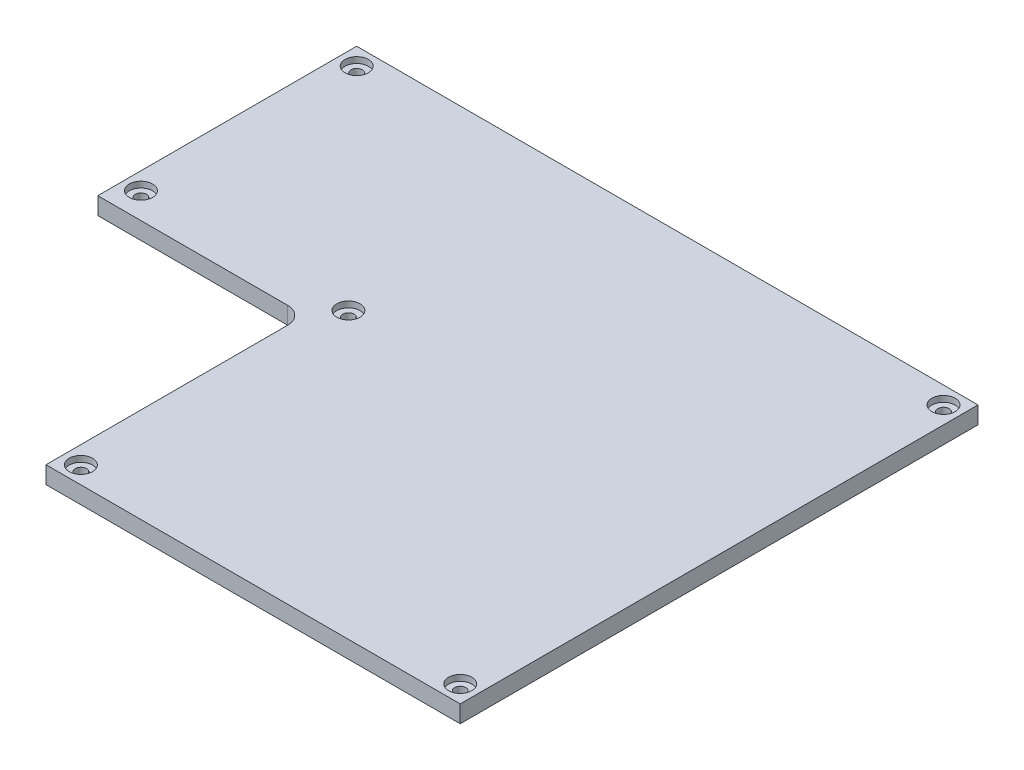
ISO-10303-21;
HEADER;
FILE_DESCRIPTION(('STEP AP214'),'2;1');
FILE_NAME('part.step','',(''),(''),'','','');
FILE_SCHEMA(('AUTOMOTIVE_DESIGN { 1 0 10303 214 1 1 1 1 }'));
ENDSEC;
DATA;
#1=APPLICATION_CONTEXT('core data for automotive mechanical design processes');
#2=APPLICATION_PROTOCOL_DEFINITION('international standard','automotive_design',2000,#1);
#3=PRODUCT_CONTEXT('',#1,'mechanical');
#4=PRODUCT('Part','Part','',(#3));
#5=PRODUCT_RELATED_PRODUCT_CATEGORY('part','',(#4));
#6=PRODUCT_DEFINITION_FORMATION('','',#4);
#7=PRODUCT_DEFINITION_CONTEXT('part definition',#1,'design');
#8=PRODUCT_DEFINITION('design','',#6,#7);
#9=PRODUCT_DEFINITION_SHAPE('','',#8);
#10=(LENGTH_UNIT() NAMED_UNIT(*) SI_UNIT(.MILLI.,.METRE.));
#11=(NAMED_UNIT(*) PLANE_ANGLE_UNIT() SI_UNIT($,.RADIAN.));
#12=(NAMED_UNIT(*) SI_UNIT($,.STERADIAN.) SOLID_ANGLE_UNIT());
#13=UNCERTAINTY_MEASURE_WITH_UNIT(LENGTH_MEASURE(1.E-05),#10,'distance_accuracy_value','');
#14=(GEOMETRIC_REPRESENTATION_CONTEXT(3) GLOBAL_UNCERTAINTY_ASSIGNED_CONTEXT((#13)) GLOBAL_UNIT_ASSIGNED_CONTEXT((#10,
#11,#12)) REPRESENTATION_CONTEXT('',''));
#15=CARTESIAN_POINT('',(0.,0.,0.));
#16=DIRECTION('',(0.,0.,1.));
#17=DIRECTION('',(1.,0.,0.));
#18=AXIS2_PLACEMENT_3D('',#15,#16,#17);
#19=CARTESIAN_POINT('',(-15.9558823529412,5.,23.9705882352941));
#20=DIRECTION('',(0.,-1.,0.));
#21=DIRECTION('',(0.,0.,-1.));
#22=AXIS2_PLACEMENT_3D('',#19,#20,#21);
#23=CYLINDRICAL_SURFACE('',#22,5.);
#24=CARTESIAN_POINT('',(-15.9558823529412,0.,23.9705882352941));
#25=DIRECTION('',(0.,1.,0.));
#26=DIRECTION('',(0.,0.,1.));
#27=AXIS2_PLACEMENT_3D('',#24,#25,#26);
#28=CIRCLE('',#27,5.);
#29=CARTESIAN_POINT('',(-10.9558823529412,0.,23.9705882352942));
#30=VERTEX_POINT('',#29);
#31=CARTESIAN_POINT('',(-15.9558823529412,0.,18.9705882352941));
#32=VERTEX_POINT('',#31);
#33=EDGE_CURVE('E127',#30,#32,#28,.T.);
#34=ORIENTED_EDGE('',*,*,#33,.F.);
#35=DIRECTION('',(0.,-1.,0.));
#36=VECTOR('',#35,1.);
#37=CARTESIAN_POINT('',(-10.9558823529412,5.,23.9705882352942));
#38=LINE('',#37,#36);
#39=CARTESIAN_POINT('',(-10.9558823529412,5.,23.9705882352942));
#40=VERTEX_POINT('',#39);
#41=EDGE_CURVE('E11',#40,#30,#38,.T.);
#42=ORIENTED_EDGE('',*,*,#41,.F.);
#43=CARTESIAN_POINT('',(-15.9558823529412,5.,23.9705882352941));
#44=DIRECTION('',(0.,1.,0.));
#45=DIRECTION('',(0.,0.,1.));
#46=AXIS2_PLACEMENT_3D('',#43,#44,#45);
#47=CIRCLE('',#46,5.);
#48=CARTESIAN_POINT('',(-15.9558823529412,5.,18.9705882352941));
#49=VERTEX_POINT('',#48);
#50=EDGE_CURVE('E144',#40,#49,#47,.T.);
#51=ORIENTED_EDGE('',*,*,#50,.T.);
#52=DIRECTION('',(0.,-1.,0.));
#53=VECTOR('',#52,1.);
#54=CARTESIAN_POINT('',(-15.9558823529412,5.,18.9705882352941));
#55=LINE('',#54,#53);
#56=EDGE_CURVE('E85',#49,#32,#55,.T.);
#57=ORIENTED_EDGE('',*,*,#56,.T.);
#58=EDGE_LOOP('',(#34,#42,#51,#57));
#59=FACE_BOUND('',#58,.T.);
#60=ADVANCED_FACE('F38',(#59),#23,.F.);
#61=CARTESIAN_POINT('',(-10.9558823529412,5.,0.));
#62=DIRECTION('',(1.,0.,0.));
#63=DIRECTION('',(0.,0.,-1.));
#64=AXIS2_PLACEMENT_3D('',#61,#62,#63);
#65=PLANE('',#64);
#66=DIRECTION('',(0.,0.,1.));
#67=VECTOR('',#66,1.);
#68=CARTESIAN_POINT('',(-10.9558823529412,0.,0.));
#69=LINE('',#68,#67);
#70=CARTESIAN_POINT('',(-10.9558823529411,0.,93.9705882352941));
#71=VERTEX_POINT('',#70);
#72=EDGE_CURVE('E130',#30,#71,#69,.T.);
#73=ORIENTED_EDGE('',*,*,#72,.T.);
#74=DIRECTION('',(0.,-1.,0.));
#75=VECTOR('',#74,1.);
#76=CARTESIAN_POINT('',(-10.9558823529411,5.,93.9705882352941));
#77=LINE('',#76,#75);
#78=CARTESIAN_POINT('',(-10.9558823529411,5.,93.9705882352941));
#79=VERTEX_POINT('',#78);
#80=EDGE_CURVE('E46',#79,#71,#77,.T.);
#81=ORIENTED_EDGE('',*,*,#80,.F.);
#82=DIRECTION('',(0.,0.,1.));
#83=VECTOR('',#82,1.);
#84=CARTESIAN_POINT('',(-10.9558823529412,5.,0.));
#85=LINE('',#84,#83);
#86=EDGE_CURVE('E162',#40,#79,#85,.T.);
#87=ORIENTED_EDGE('',*,*,#86,.F.);
#88=ORIENTED_EDGE('',*,*,#41,.T.);
#89=EDGE_LOOP('',(#73,#81,#87,#88));
#90=FACE_BOUND('',#89,.T.);
#91=ADVANCED_FACE('F156',(#90),#65,.F.);
#92=CARTESIAN_POINT('',(0.,5.,93.9705882352941));
#93=DIRECTION('',(0.,0.,1.));
#94=DIRECTION('',(1.,0.,0.));
#95=AXIS2_PLACEMENT_3D('',#92,#93,#94);
#96=PLANE('',#95);
#97=DIRECTION('',(-1.,0.,0.));
#98=VECTOR('',#97,1.);
#99=CARTESIAN_POINT('',(0.,0.,93.9705882352941));
#100=LINE('',#99,#98);
#101=CARTESIAN_POINT('',(109.044117647059,0.,93.9705882352941));
#102=VERTEX_POINT('',#101);
#103=EDGE_CURVE('E134',#102,#71,#100,.T.);
#104=ORIENTED_EDGE('',*,*,#103,.F.);
#105=DIRECTION('',(0.,-1.,0.));
#106=VECTOR('',#105,1.);
#107=CARTESIAN_POINT('',(109.044117647059,5.,93.9705882352941));
#108=LINE('',#107,#106);
#109=CARTESIAN_POINT('',(109.044117647059,5.,93.9705882352941));
#110=VERTEX_POINT('',#109);
#111=EDGE_CURVE('E148',#110,#102,#108,.T.);
#112=ORIENTED_EDGE('',*,*,#111,.F.);
#113=DIRECTION('',(-1.,0.,0.));
#114=VECTOR('',#113,1.);
#115=CARTESIAN_POINT('',(0.,5.,93.9705882352941));
#116=LINE('',#115,#114);
#117=EDGE_CURVE('E122',#110,#79,#116,.T.);
#118=ORIENTED_EDGE('',*,*,#117,.T.);
#119=ORIENTED_EDGE('',*,*,#80,.T.);
#120=EDGE_LOOP('',(#104,#112,#118,#119));
#121=FACE_BOUND('',#120,.T.);
#122=ADVANCED_FACE('F153',(#121),#96,.T.);
#123=CARTESIAN_POINT('',(109.044117647059,5.,0.));
#124=DIRECTION('',(1.,0.,0.));
#125=DIRECTION('',(0.,0.,-1.));
#126=AXIS2_PLACEMENT_3D('',#123,#124,#125);
#127=PLANE('',#126);
#128=DIRECTION('',(0.,0.,1.));
#129=VECTOR('',#128,1.);
#130=CARTESIAN_POINT('',(109.044117647059,0.,0.));
#131=LINE('',#130,#129);
#132=CARTESIAN_POINT('',(109.044117647059,0.,-56.0294117647059));
#133=VERTEX_POINT('',#132);
#134=EDGE_CURVE('E137',#133,#102,#131,.T.);
#135=ORIENTED_EDGE('',*,*,#134,.F.);
#136=DIRECTION('',(0.,-1.,0.));
#137=VECTOR('',#136,1.);
#138=CARTESIAN_POINT('',(109.044117647059,5.,-56.0294117647059));
#139=LINE('',#138,#137);
#140=CARTESIAN_POINT('',(109.044117647059,5.,-56.0294117647059));
#141=VERTEX_POINT('',#140);
#142=EDGE_CURVE('E110',#141,#133,#139,.T.);
#143=ORIENTED_EDGE('',*,*,#142,.F.);
#144=DIRECTION('',(0.,0.,1.));
#145=VECTOR('',#144,1.);
#146=CARTESIAN_POINT('',(109.044117647059,5.,0.));
#147=LINE('',#146,#145);
#148=EDGE_CURVE('E120',#141,#110,#147,.T.);
#149=ORIENTED_EDGE('',*,*,#148,.T.);
#150=ORIENTED_EDGE('',*,*,#111,.T.);
#151=EDGE_LOOP('',(#135,#143,#149,#150));
#152=FACE_BOUND('',#151,.T.);
#153=ADVANCED_FACE('F161',(#152),#127,.T.);
#154=CARTESIAN_POINT('',(0.,5.,-56.0294117647059));
#155=DIRECTION('',(0.,0.,-1.));
#156=DIRECTION('',(-1.,0.,0.));
#157=AXIS2_PLACEMENT_3D('',#154,#155,#156);
#158=PLANE('',#157);
#159=DIRECTION('',(1.,0.,0.));
#160=VECTOR('',#159,1.);
#161=CARTESIAN_POINT('',(0.,0.,-56.0294117647059));
#162=LINE('',#161,#160);
#163=CARTESIAN_POINT('',(-70.9558823529412,0.,-56.0294117647059));
#164=VERTEX_POINT('',#163);
#165=EDGE_CURVE('E109',#164,#133,#162,.T.);
#166=ORIENTED_EDGE('',*,*,#165,.F.);
#167=DIRECTION('',(0.,-1.,0.));
#168=VECTOR('',#167,1.);
#169=CARTESIAN_POINT('',(-70.9558823529412,5.,-56.0294117647059));
#170=LINE('',#169,#168);
#171=CARTESIAN_POINT('',(-70.9558823529412,5.,-56.0294117647059));
#172=VERTEX_POINT('',#171);
#173=EDGE_CURVE('E103',#172,#164,#170,.T.);
#174=ORIENTED_EDGE('',*,*,#173,.F.);
#175=DIRECTION('',(1.,0.,0.));
#176=VECTOR('',#175,1.);
#177=CARTESIAN_POINT('',(0.,5.,-56.0294117647059));
#178=LINE('',#177,#176);
#179=EDGE_CURVE('E107',#172,#141,#178,.T.);
#180=ORIENTED_EDGE('',*,*,#179,.T.);
#181=ORIENTED_EDGE('',*,*,#142,.T.);
#182=EDGE_LOOP('',(#166,#174,#180,#181));
#183=FACE_BOUND('',#182,.T.);
#184=ADVANCED_FACE('F105',(#183),#158,.T.);
#185=CARTESIAN_POINT('',(-70.9558823529412,5.,0.));
#186=DIRECTION('',(1.,0.,0.));
#187=DIRECTION('',(0.,0.,-1.));
#188=AXIS2_PLACEMENT_3D('',#185,#186,#187);
#189=PLANE('',#188);
#190=DIRECTION('',(0.,0.,1.));
#191=VECTOR('',#190,1.);
#192=CARTESIAN_POINT('',(-70.9558823529412,0.,0.));
#193=LINE('',#192,#191);
#194=CARTESIAN_POINT('',(-70.9558823529411,0.,18.9705882352941));
#195=VERTEX_POINT('',#194);
#196=EDGE_CURVE('E78',#164,#195,#193,.T.);
#197=ORIENTED_EDGE('',*,*,#196,.T.);
#198=DIRECTION('',(0.,-1.,0.));
#199=VECTOR('',#198,1.);
#200=CARTESIAN_POINT('',(-70.9558823529411,5.,18.9705882352941));
#201=LINE('',#200,#199);
#202=CARTESIAN_POINT('',(-70.9558823529411,5.,18.9705882352941));
#203=VERTEX_POINT('',#202);
#204=EDGE_CURVE('E111',#203,#195,#201,.T.);
#205=ORIENTED_EDGE('',*,*,#204,.F.);
#206=DIRECTION('',(0.,0.,1.));
#207=VECTOR('',#206,1.);
#208=CARTESIAN_POINT('',(-70.9558823529412,5.,0.));
#209=LINE('',#208,#207);
#210=EDGE_CURVE('E113',#172,#203,#209,.T.);
#211=ORIENTED_EDGE('',*,*,#210,.F.);
#212=ORIENTED_EDGE('',*,*,#173,.T.);
#213=EDGE_LOOP('',(#197,#205,#211,#212));
#214=FACE_BOUND('',#213,.T.);
#215=ADVANCED_FACE('F114',(#214),#189,.F.);
#216=CARTESIAN_POINT('',(0.,5.,18.9705882352941));
#217=DIRECTION('',(0.,0.,-1.));
#218=DIRECTION('',(-1.,0.,0.));
#219=AXIS2_PLACEMENT_3D('',#216,#217,#218);
#220=PLANE('',#219);
#221=DIRECTION('',(1.,0.,0.));
#222=VECTOR('',#221,1.);
#223=CARTESIAN_POINT('',(0.,0.,18.9705882352941));
#224=LINE('',#223,#222);
#225=EDGE_CURVE('E142',#195,#32,#224,.T.);
#226=ORIENTED_EDGE('',*,*,#225,.T.);
#227=ORIENTED_EDGE('',*,*,#56,.F.);
#228=DIRECTION('',(1.,0.,0.));
#229=VECTOR('',#228,1.);
#230=CARTESIAN_POINT('',(0.,5.,18.9705882352941));
#231=LINE('',#230,#229);
#232=EDGE_CURVE('E54',#203,#49,#231,.T.);
#233=ORIENTED_EDGE('',*,*,#232,.F.);
#234=ORIENTED_EDGE('',*,*,#204,.T.);
#235=EDGE_LOOP('',(#226,#227,#233,#234));
#236=FACE_BOUND('',#235,.T.);
#237=ADVANCED_FACE('F242',(#236),#220,.F.);
#238=CARTESIAN_POINT('',(0.,5.,0.));
#239=DIRECTION('',(0.,1.,0.));
#240=DIRECTION('',(0.,0.,1.));
#241=AXIS2_PLACEMENT_3D('',#238,#239,#240);
#242=PLANE('',#241);
#243=CARTESIAN_POINT('',(-65.9558823529412,5.,-51.0294117647059));
#244=DIRECTION('',(0.,1.,0.));
#245=DIRECTION('',(0.,0.,1.));
#246=AXIS2_PLACEMENT_3D('',#243,#244,#245);
#247=CIRCLE('',#246,3.37312000000001);
#248=CARTESIAN_POINT('',(-65.9558823529412,5.,-47.6562917647059));
#249=VERTEX_POINT('',#248);
#250=EDGE_CURVE('E234',#249,#249,#247,.T.);
#251=ORIENTED_EDGE('',*,*,#250,.F.);
#252=EDGE_LOOP('',(#251));
#253=FACE_BOUND('',#252,.T.);
#254=CARTESIAN_POINT('',(-65.9558823529412,5.,11.4705882352941));
#255=DIRECTION('',(0.,1.,0.));
#256=DIRECTION('',(0.,0.,1.));
#257=AXIS2_PLACEMENT_3D('',#254,#255,#256);
#258=CIRCLE('',#257,3.37312000000001);
#259=CARTESIAN_POINT('',(-65.9558823529412,5.,14.8437082352941));
#260=VERTEX_POINT('',#259);
#261=EDGE_CURVE('E222',#260,#260,#258,.T.);
#262=ORIENTED_EDGE('',*,*,#261,.F.);
#263=EDGE_LOOP('',(#262));
#264=FACE_BOUND('',#263,.T.);
#265=CARTESIAN_POINT('',(-5.84588235294117,5.,11.4705882352941));
#266=DIRECTION('',(0.,1.,0.));
#267=DIRECTION('',(0.,0.,1.));
#268=AXIS2_PLACEMENT_3D('',#265,#266,#267);
#269=CIRCLE('',#268,3.37312);
#270=CARTESIAN_POINT('',(-5.84588235294117,5.,14.8437082352941));
#271=VERTEX_POINT('',#270);
#272=EDGE_CURVE('E210',#271,#271,#269,.T.);
#273=ORIENTED_EDGE('',*,*,#272,.F.);
#274=EDGE_LOOP('',(#273));
#275=FACE_BOUND('',#274,.T.);
#276=CARTESIAN_POINT('',(-5.84588235294116,5.,88.9705882352941));
#277=DIRECTION('',(0.,1.,0.));
#278=DIRECTION('',(0.,0.,1.));
#279=AXIS2_PLACEMENT_3D('',#276,#277,#278);
#280=CIRCLE('',#279,3.37312);
#281=CARTESIAN_POINT('',(-5.84588235294116,5.,92.3437082352941));
#282=VERTEX_POINT('',#281);
#283=EDGE_CURVE('E198',#282,#282,#280,.T.);
#284=ORIENTED_EDGE('',*,*,#283,.F.);
#285=EDGE_LOOP('',(#284));
#286=FACE_BOUND('',#285,.T.);
#287=CARTESIAN_POINT('',(104.044117647059,5.,88.9705882352941));
#288=DIRECTION('',(0.,1.,0.));
#289=DIRECTION('',(0.,0.,1.));
#290=AXIS2_PLACEMENT_3D('',#287,#288,#289);
#291=CIRCLE('',#290,3.37312000000001);
#292=CARTESIAN_POINT('',(104.044117647059,5.,92.3437082352941));
#293=VERTEX_POINT('',#292);
#294=EDGE_CURVE('E186',#293,#293,#291,.T.);
#295=ORIENTED_EDGE('',*,*,#294,.F.);
#296=EDGE_LOOP('',(#295));
#297=FACE_BOUND('',#296,.T.);
#298=CARTESIAN_POINT('',(104.044117647059,5.,-51.0294117647059));
#299=DIRECTION('',(0.,1.,0.));
#300=DIRECTION('',(0.,0.,1.));
#301=AXIS2_PLACEMENT_3D('',#298,#299,#300);
#302=CIRCLE('',#301,3.37312000000001);
#303=CARTESIAN_POINT('',(104.044117647059,5.,-47.6562917647059));
#304=VERTEX_POINT('',#303);
#305=EDGE_CURVE('E174',#304,#304,#302,.T.);
#306=ORIENTED_EDGE('',*,*,#305,.F.);
#307=EDGE_LOOP('',(#306));
#308=FACE_BOUND('',#307,.T.);
#309=ORIENTED_EDGE('',*,*,#50,.F.);
#310=ORIENTED_EDGE('',*,*,#86,.T.);
#311=ORIENTED_EDGE('',*,*,#117,.F.);
#312=ORIENTED_EDGE('',*,*,#148,.F.);
#313=ORIENTED_EDGE('',*,*,#179,.F.);
#314=ORIENTED_EDGE('',*,*,#210,.T.);
#315=ORIENTED_EDGE('',*,*,#232,.T.);
#316=EDGE_LOOP('',(#309,#310,#311,#312,#313,#314,#315));
#317=FACE_BOUND('',#316,.T.);
#318=ADVANCED_FACE('F117',(#253,#264,#275,#286,#297,#308,#317),#242,.T.);
#319=CARTESIAN_POINT('',(0.,0.,0.));
#320=DIRECTION('',(0.,1.,0.));
#321=DIRECTION('',(0.,0.,1.));
#322=AXIS2_PLACEMENT_3D('',#319,#320,#321);
#323=PLANE('',#322);
#324=CARTESIAN_POINT('',(-65.9558823529412,0.,-51.0294117647059));
#325=DIRECTION('',(0.,1.,0.));
#326=DIRECTION('',(0.,0.,1.));
#327=AXIS2_PLACEMENT_3D('',#324,#325,#326);
#328=CIRCLE('',#327,1.63195);
#329=CARTESIAN_POINT('',(-65.9558823529412,0.,-49.3974617647059));
#330=VERTEX_POINT('',#329);
#331=EDGE_CURVE('E225',#330,#330,#328,.T.);
#332=ORIENTED_EDGE('',*,*,#331,.T.);
#333=EDGE_LOOP('',(#332));
#334=FACE_BOUND('',#333,.T.);
#335=CARTESIAN_POINT('',(-65.9558823529412,0.,11.4705882352941));
#336=DIRECTION('',(0.,1.,0.));
#337=DIRECTION('',(0.,0.,1.));
#338=AXIS2_PLACEMENT_3D('',#335,#336,#337);
#339=CIRCLE('',#338,1.63195);
#340=CARTESIAN_POINT('',(-65.9558823529412,0.,13.1025382352941));
#341=VERTEX_POINT('',#340);
#342=EDGE_CURVE('E213',#341,#341,#339,.T.);
#343=ORIENTED_EDGE('',*,*,#342,.T.);
#344=EDGE_LOOP('',(#343));
#345=FACE_BOUND('',#344,.T.);
#346=CARTESIAN_POINT('',(-5.84588235294117,0.,11.4705882352941));
#347=DIRECTION('',(0.,1.,0.));
#348=DIRECTION('',(0.,0.,1.));
#349=AXIS2_PLACEMENT_3D('',#346,#347,#348);
#350=CIRCLE('',#349,1.63195);
#351=CARTESIAN_POINT('',(-5.84588235294117,0.,13.1025382352941));
#352=VERTEX_POINT('',#351);
#353=EDGE_CURVE('E201',#352,#352,#350,.T.);
#354=ORIENTED_EDGE('',*,*,#353,.T.);
#355=EDGE_LOOP('',(#354));
#356=FACE_BOUND('',#355,.T.);
#357=CARTESIAN_POINT('',(-5.84588235294116,0.,88.9705882352941));
#358=DIRECTION('',(0.,1.,0.));
#359=DIRECTION('',(0.,0.,1.));
#360=AXIS2_PLACEMENT_3D('',#357,#358,#359);
#361=CIRCLE('',#360,1.63195);
#362=CARTESIAN_POINT('',(-5.84588235294116,0.,90.6025382352941));
#363=VERTEX_POINT('',#362);
#364=EDGE_CURVE('E189',#363,#363,#361,.T.);
#365=ORIENTED_EDGE('',*,*,#364,.T.);
#366=EDGE_LOOP('',(#365));
#367=FACE_BOUND('',#366,.T.);
#368=CARTESIAN_POINT('',(104.044117647059,0.,88.9705882352941));
#369=DIRECTION('',(0.,1.,0.));
#370=DIRECTION('',(0.,0.,1.));
#371=AXIS2_PLACEMENT_3D('',#368,#369,#370);
#372=CIRCLE('',#371,1.63195);
#373=CARTESIAN_POINT('',(104.044117647059,0.,90.6025382352941));
#374=VERTEX_POINT('',#373);
#375=EDGE_CURVE('E177',#374,#374,#372,.T.);
#376=ORIENTED_EDGE('',*,*,#375,.T.);
#377=EDGE_LOOP('',(#376));
#378=FACE_BOUND('',#377,.T.);
#379=CARTESIAN_POINT('',(104.044117647059,0.,-51.0294117647059));
#380=DIRECTION('',(0.,1.,0.));
#381=DIRECTION('',(0.,0.,1.));
#382=AXIS2_PLACEMENT_3D('',#379,#380,#381);
#383=CIRCLE('',#382,1.63195);
#384=CARTESIAN_POINT('',(104.044117647059,0.,-49.3974617647059));
#385=VERTEX_POINT('',#384);
#386=EDGE_CURVE('E131',#385,#385,#383,.T.);
#387=ORIENTED_EDGE('',*,*,#386,.T.);
#388=EDGE_LOOP('',(#387));
#389=FACE_BOUND('',#388,.T.);
#390=ORIENTED_EDGE('',*,*,#33,.T.);
#391=ORIENTED_EDGE('',*,*,#225,.F.);
#392=ORIENTED_EDGE('',*,*,#196,.F.);
#393=ORIENTED_EDGE('',*,*,#165,.T.);
#394=ORIENTED_EDGE('',*,*,#134,.T.);
#395=ORIENTED_EDGE('',*,*,#103,.T.);
#396=ORIENTED_EDGE('',*,*,#72,.F.);
#397=EDGE_LOOP('',(#390,#391,#392,#393,#394,#395,#396));
#398=FACE_BOUND('',#397,.T.);
#399=ADVANCED_FACE('F158',(#334,#345,#356,#367,#378,#389,#398),#323,.F.);
#400=CARTESIAN_POINT('',(104.044117647059,5.,-51.0294117647059));
#401=DIRECTION('',(0.,1.,0.));
#402=DIRECTION('',(0.,0.,1.));
#403=AXIS2_PLACEMENT_3D('',#400,#401,#402);
#404=CYLINDRICAL_SURFACE('',#403,1.63195);
#405=ORIENTED_EDGE('',*,*,#386,.F.);
#406=EDGE_LOOP('',(#405));
#407=FACE_BOUND('',#406,.T.);
#408=CARTESIAN_POINT('',(104.044117647059,3.2728,-51.0294117647059));
#409=DIRECTION('',(0.,1.,0.));
#410=DIRECTION('',(0.,0.,1.));
#411=AXIS2_PLACEMENT_3D('',#408,#409,#410);
#412=CIRCLE('',#411,1.63195000000001);
#413=CARTESIAN_POINT('',(104.044117647059,3.2728,-49.3974617647059));
#414=VERTEX_POINT('',#413);
#415=EDGE_CURVE('E168',#414,#414,#412,.T.);
#416=ORIENTED_EDGE('',*,*,#415,.T.);
#417=EDGE_LOOP('',(#416));
#418=FACE_BOUND('',#417,.T.);
#419=ADVANCED_FACE('F267',(#407,#418),#404,.F.);
#420=CARTESIAN_POINT('',(105.676067647059,3.2728,-51.0294117647059));
#421=DIRECTION('',(0.,-1.,0.));
#422=DIRECTION('',(0.,0.,-1.));
#423=AXIS2_PLACEMENT_3D('',#420,#421,#422);
#424=PLANE('',#423);
#425=ORIENTED_EDGE('',*,*,#415,.F.);
#426=EDGE_LOOP('',(#425));
#427=FACE_BOUND('',#426,.T.);
#428=CARTESIAN_POINT('',(104.044117647059,3.2728,-51.0294117647059));
#429=DIRECTION('',(0.,1.,0.));
#430=DIRECTION('',(0.,0.,1.));
#431=AXIS2_PLACEMENT_3D('',#428,#429,#430);
#432=CIRCLE('',#431,3.37311999999999);
#433=CARTESIAN_POINT('',(104.044117647059,3.2728,-47.6562917647059));
#434=VERTEX_POINT('',#433);
#435=EDGE_CURVE('E171',#434,#434,#432,.T.);
#436=ORIENTED_EDGE('',*,*,#435,.T.);
#437=EDGE_LOOP('',(#436));
#438=FACE_BOUND('',#437,.T.);
#439=ADVANCED_FACE('F257',(#427,#438),#424,.F.);
#440=CARTESIAN_POINT('',(104.044117647059,5.,-51.0294117647059));
#441=DIRECTION('',(0.,1.,0.));
#442=DIRECTION('',(0.,0.,1.));
#443=AXIS2_PLACEMENT_3D('',#440,#441,#442);
#444=CYLINDRICAL_SURFACE('',#443,3.37312);
#445=ORIENTED_EDGE('',*,*,#435,.F.);
#446=EDGE_LOOP('',(#445));
#447=FACE_BOUND('',#446,.T.);
#448=ORIENTED_EDGE('',*,*,#305,.T.);
#449=EDGE_LOOP('',(#448));
#450=FACE_BOUND('',#449,.T.);
#451=ADVANCED_FACE('F254',(#447,#450),#444,.F.);
#452=CARTESIAN_POINT('',(104.044117647059,5.,88.9705882352941));
#453=DIRECTION('',(0.,1.,0.));
#454=DIRECTION('',(0.,0.,1.));
#455=AXIS2_PLACEMENT_3D('',#452,#453,#454);
#456=CYLINDRICAL_SURFACE('',#455,1.63195);
#457=ORIENTED_EDGE('',*,*,#375,.F.);
#458=EDGE_LOOP('',(#457));
#459=FACE_BOUND('',#458,.T.);
#460=CARTESIAN_POINT('',(104.044117647059,3.2728,88.9705882352941));
#461=DIRECTION('',(0.,1.,0.));
#462=DIRECTION('',(0.,0.,1.));
#463=AXIS2_PLACEMENT_3D('',#460,#461,#462);
#464=CIRCLE('',#463,1.63195000000001);
#465=CARTESIAN_POINT('',(104.044117647059,3.2728,90.6025382352941));
#466=VERTEX_POINT('',#465);
#467=EDGE_CURVE('E180',#466,#466,#464,.T.);
#468=ORIENTED_EDGE('',*,*,#467,.T.);
#469=EDGE_LOOP('',(#468));
#470=FACE_BOUND('',#469,.T.);
#471=ADVANCED_FACE('F256',(#459,#470),#456,.F.);
#472=CARTESIAN_POINT('',(105.676067647059,3.2728,88.9705882352941));
#473=DIRECTION('',(0.,-1.,0.));
#474=DIRECTION('',(0.,0.,-1.));
#475=AXIS2_PLACEMENT_3D('',#472,#473,#474);
#476=PLANE('',#475);
#477=ORIENTED_EDGE('',*,*,#467,.F.);
#478=EDGE_LOOP('',(#477));
#479=FACE_BOUND('',#478,.T.);
#480=CARTESIAN_POINT('',(104.044117647059,3.2728,88.9705882352941));
#481=DIRECTION('',(0.,1.,0.));
#482=DIRECTION('',(0.,0.,1.));
#483=AXIS2_PLACEMENT_3D('',#480,#481,#482);
#484=CIRCLE('',#483,3.37311999999999);
#485=CARTESIAN_POINT('',(104.044117647059,3.2728,92.3437082352941));
#486=VERTEX_POINT('',#485);
#487=EDGE_CURVE('E183',#486,#486,#484,.T.);
#488=ORIENTED_EDGE('',*,*,#487,.T.);
#489=EDGE_LOOP('',(#488));
#490=FACE_BOUND('',#489,.T.);
#491=ADVANCED_FACE('F264',(#479,#490),#476,.F.);
#492=CARTESIAN_POINT('',(104.044117647059,5.,88.9705882352941));
#493=DIRECTION('',(0.,1.,0.));
#494=DIRECTION('',(0.,0.,1.));
#495=AXIS2_PLACEMENT_3D('',#492,#493,#494);
#496=CYLINDRICAL_SURFACE('',#495,3.37312);
#497=ORIENTED_EDGE('',*,*,#487,.F.);
#498=EDGE_LOOP('',(#497));
#499=FACE_BOUND('',#498,.T.);
#500=ORIENTED_EDGE('',*,*,#294,.T.);
#501=EDGE_LOOP('',(#500));
#502=FACE_BOUND('',#501,.T.);
#503=ADVANCED_FACE('F358',(#499,#502),#496,.F.);
#504=CARTESIAN_POINT('',(-5.84588235294116,5.,88.9705882352941));
#505=DIRECTION('',(0.,1.,0.));
#506=DIRECTION('',(0.,0.,1.));
#507=AXIS2_PLACEMENT_3D('',#504,#505,#506);
#508=CYLINDRICAL_SURFACE('',#507,1.63195);
#509=ORIENTED_EDGE('',*,*,#364,.F.);
#510=EDGE_LOOP('',(#509));
#511=FACE_BOUND('',#510,.T.);
#512=CARTESIAN_POINT('',(-5.84588235294116,3.2728,88.9705882352941));
#513=DIRECTION('',(0.,1.,0.));
#514=DIRECTION('',(0.,0.,1.));
#515=AXIS2_PLACEMENT_3D('',#512,#513,#514);
#516=CIRCLE('',#515,1.63195);
#517=CARTESIAN_POINT('',(-5.84588235294116,3.2728,90.6025382352941));
#518=VERTEX_POINT('',#517);
#519=EDGE_CURVE('E192',#518,#518,#516,.T.);
#520=ORIENTED_EDGE('',*,*,#519,.T.);
#521=EDGE_LOOP('',(#520));
#522=FACE_BOUND('',#521,.T.);
#523=ADVANCED_FACE('F368',(#511,#522),#508,.F.);
#524=CARTESIAN_POINT('',(-4.21393235294116,3.2728,88.9705882352941));
#525=DIRECTION('',(0.,-1.,0.));
#526=DIRECTION('',(0.,0.,-1.));
#527=AXIS2_PLACEMENT_3D('',#524,#525,#526);
#528=PLANE('',#527);
#529=ORIENTED_EDGE('',*,*,#519,.F.);
#530=EDGE_LOOP('',(#529));
#531=FACE_BOUND('',#530,.T.);
#532=CARTESIAN_POINT('',(-5.84588235294116,3.2728,88.9705882352941));
#533=DIRECTION('',(0.,1.,0.));
#534=DIRECTION('',(0.,0.,1.));
#535=AXIS2_PLACEMENT_3D('',#532,#533,#534);
#536=CIRCLE('',#535,3.37312);
#537=CARTESIAN_POINT('',(-5.84588235294116,3.2728,92.3437082352941));
#538=VERTEX_POINT('',#537);
#539=EDGE_CURVE('E195',#538,#538,#536,.T.);
#540=ORIENTED_EDGE('',*,*,#539,.T.);
#541=EDGE_LOOP('',(#540));
#542=FACE_BOUND('',#541,.T.);
#543=ADVANCED_FACE('F378',(#531,#542),#528,.F.);
#544=CARTESIAN_POINT('',(-5.84588235294116,5.,88.9705882352941));
#545=DIRECTION('',(0.,1.,0.));
#546=DIRECTION('',(0.,0.,1.));
#547=AXIS2_PLACEMENT_3D('',#544,#545,#546);
#548=CYLINDRICAL_SURFACE('',#547,3.37312);
#549=ORIENTED_EDGE('',*,*,#539,.F.);
#550=EDGE_LOOP('',(#549));
#551=FACE_BOUND('',#550,.T.);
#552=ORIENTED_EDGE('',*,*,#283,.T.);
#553=EDGE_LOOP('',(#552));
#554=FACE_BOUND('',#553,.T.);
#555=ADVANCED_FACE('F388',(#551,#554),#548,.F.);
#556=CARTESIAN_POINT('',(-5.84588235294117,5.,11.4705882352941));
#557=DIRECTION('',(0.,1.,0.));
#558=DIRECTION('',(0.,0.,1.));
#559=AXIS2_PLACEMENT_3D('',#556,#557,#558);
#560=CYLINDRICAL_SURFACE('',#559,1.63195);
#561=ORIENTED_EDGE('',*,*,#353,.F.);
#562=EDGE_LOOP('',(#561));
#563=FACE_BOUND('',#562,.T.);
#564=CARTESIAN_POINT('',(-5.84588235294117,3.2728,11.4705882352941));
#565=DIRECTION('',(0.,1.,0.));
#566=DIRECTION('',(0.,0.,1.));
#567=AXIS2_PLACEMENT_3D('',#564,#565,#566);
#568=CIRCLE('',#567,1.63195);
#569=CARTESIAN_POINT('',(-5.84588235294117,3.2728,13.1025382352941));
#570=VERTEX_POINT('',#569);
#571=EDGE_CURVE('E204',#570,#570,#568,.T.);
#572=ORIENTED_EDGE('',*,*,#571,.T.);
#573=EDGE_LOOP('',(#572));
#574=FACE_BOUND('',#573,.T.);
#575=ADVANCED_FACE('F398',(#563,#574),#560,.F.);
#576=CARTESIAN_POINT('',(-4.21393235294117,3.2728,11.4705882352941));
#577=DIRECTION('',(0.,-1.,0.));
#578=DIRECTION('',(0.,0.,-1.));
#579=AXIS2_PLACEMENT_3D('',#576,#577,#578);
#580=PLANE('',#579);
#581=ORIENTED_EDGE('',*,*,#571,.F.);
#582=EDGE_LOOP('',(#581));
#583=FACE_BOUND('',#582,.T.);
#584=CARTESIAN_POINT('',(-5.84588235294117,3.2728,11.4705882352941));
#585=DIRECTION('',(0.,1.,0.));
#586=DIRECTION('',(0.,0.,1.));
#587=AXIS2_PLACEMENT_3D('',#584,#585,#586);
#588=CIRCLE('',#587,3.37312);
#589=CARTESIAN_POINT('',(-5.84588235294117,3.2728,14.8437082352941));
#590=VERTEX_POINT('',#589);
#591=EDGE_CURVE('E207',#590,#590,#588,.T.);
#592=ORIENTED_EDGE('',*,*,#591,.T.);
#593=EDGE_LOOP('',(#592));
#594=FACE_BOUND('',#593,.T.);
#595=ADVANCED_FACE('F408',(#583,#594),#580,.F.);
#596=CARTESIAN_POINT('',(-5.84588235294117,5.,11.4705882352941));
#597=DIRECTION('',(0.,1.,0.));
#598=DIRECTION('',(0.,0.,1.));
#599=AXIS2_PLACEMENT_3D('',#596,#597,#598);
#600=CYLINDRICAL_SURFACE('',#599,3.37312);
#601=ORIENTED_EDGE('',*,*,#591,.F.);
#602=EDGE_LOOP('',(#601));
#603=FACE_BOUND('',#602,.T.);
#604=ORIENTED_EDGE('',*,*,#272,.T.);
#605=EDGE_LOOP('',(#604));
#606=FACE_BOUND('',#605,.T.);
#607=ADVANCED_FACE('F418',(#603,#606),#600,.F.);
#608=CARTESIAN_POINT('',(-65.9558823529412,5.,11.4705882352941));
#609=DIRECTION('',(0.,1.,0.));
#610=DIRECTION('',(0.,0.,1.));
#611=AXIS2_PLACEMENT_3D('',#608,#609,#610);
#612=CYLINDRICAL_SURFACE('',#611,1.63195);
#613=ORIENTED_EDGE('',*,*,#342,.F.);
#614=EDGE_LOOP('',(#613));
#615=FACE_BOUND('',#614,.T.);
#616=CARTESIAN_POINT('',(-65.9558823529412,3.2728,11.4705882352941));
#617=DIRECTION('',(0.,1.,0.));
#618=DIRECTION('',(0.,0.,1.));
#619=AXIS2_PLACEMENT_3D('',#616,#617,#618);
#620=CIRCLE('',#619,1.63195000000001);
#621=CARTESIAN_POINT('',(-65.9558823529412,3.2728,13.1025382352941));
#622=VERTEX_POINT('',#621);
#623=EDGE_CURVE('E216',#622,#622,#620,.T.);
#624=ORIENTED_EDGE('',*,*,#623,.T.);
#625=EDGE_LOOP('',(#624));
#626=FACE_BOUND('',#625,.T.);
#627=ADVANCED_FACE('F428',(#615,#626),#612,.F.);
#628=CARTESIAN_POINT('',(-64.3239323529412,3.2728,11.4705882352941));
#629=DIRECTION('',(0.,-1.,0.));
#630=DIRECTION('',(0.,0.,-1.));
#631=AXIS2_PLACEMENT_3D('',#628,#629,#630);
#632=PLANE('',#631);
#633=ORIENTED_EDGE('',*,*,#623,.F.);
#634=EDGE_LOOP('',(#633));
#635=FACE_BOUND('',#634,.T.);
#636=CARTESIAN_POINT('',(-65.9558823529412,3.2728,11.4705882352941));
#637=DIRECTION('',(0.,1.,0.));
#638=DIRECTION('',(0.,0.,1.));
#639=AXIS2_PLACEMENT_3D('',#636,#637,#638);
#640=CIRCLE('',#639,3.37311999999999);
#641=CARTESIAN_POINT('',(-65.9558823529412,3.2728,14.8437082352941));
#642=VERTEX_POINT('',#641);
#643=EDGE_CURVE('E219',#642,#642,#640,.T.);
#644=ORIENTED_EDGE('',*,*,#643,.T.);
#645=EDGE_LOOP('',(#644));
#646=FACE_BOUND('',#645,.T.);
#647=ADVANCED_FACE('F438',(#635,#646),#632,.F.);
#648=CARTESIAN_POINT('',(-65.9558823529412,5.,11.4705882352941));
#649=DIRECTION('',(0.,1.,0.));
#650=DIRECTION('',(0.,0.,1.));
#651=AXIS2_PLACEMENT_3D('',#648,#649,#650);
#652=CYLINDRICAL_SURFACE('',#651,3.37312);
#653=ORIENTED_EDGE('',*,*,#643,.F.);
#654=EDGE_LOOP('',(#653));
#655=FACE_BOUND('',#654,.T.);
#656=ORIENTED_EDGE('',*,*,#261,.T.);
#657=EDGE_LOOP('',(#656));
#658=FACE_BOUND('',#657,.T.);
#659=ADVANCED_FACE('F448',(#655,#658),#652,.F.);
#660=CARTESIAN_POINT('',(-65.9558823529412,5.,-51.0294117647059));
#661=DIRECTION('',(0.,1.,0.));
#662=DIRECTION('',(0.,0.,1.));
#663=AXIS2_PLACEMENT_3D('',#660,#661,#662);
#664=CYLINDRICAL_SURFACE('',#663,1.63195);
#665=ORIENTED_EDGE('',*,*,#331,.F.);
#666=EDGE_LOOP('',(#665));
#667=FACE_BOUND('',#666,.T.);
#668=CARTESIAN_POINT('',(-65.9558823529412,3.2728,-51.0294117647059));
#669=DIRECTION('',(0.,1.,0.));
#670=DIRECTION('',(0.,0.,1.));
#671=AXIS2_PLACEMENT_3D('',#668,#669,#670);
#672=CIRCLE('',#671,1.63195000000001);
#673=CARTESIAN_POINT('',(-65.9558823529412,3.2728,-49.3974617647059));
#674=VERTEX_POINT('',#673);
#675=EDGE_CURVE('E228',#674,#674,#672,.T.);
#676=ORIENTED_EDGE('',*,*,#675,.T.);
#677=EDGE_LOOP('',(#676));
#678=FACE_BOUND('',#677,.T.);
#679=ADVANCED_FACE('F458',(#667,#678),#664,.F.);
#680=CARTESIAN_POINT('',(-64.3239323529412,3.2728,-51.0294117647059));
#681=DIRECTION('',(0.,-1.,0.));
#682=DIRECTION('',(0.,0.,-1.));
#683=AXIS2_PLACEMENT_3D('',#680,#681,#682);
#684=PLANE('',#683);
#685=ORIENTED_EDGE('',*,*,#675,.F.);
#686=EDGE_LOOP('',(#685));
#687=FACE_BOUND('',#686,.T.);
#688=CARTESIAN_POINT('',(-65.9558823529412,3.2728,-51.0294117647059));
#689=DIRECTION('',(0.,1.,0.));
#690=DIRECTION('',(0.,0.,1.));
#691=AXIS2_PLACEMENT_3D('',#688,#689,#690);
#692=CIRCLE('',#691,3.37311999999999);
#693=CARTESIAN_POINT('',(-65.9558823529412,3.2728,-47.6562917647059));
#694=VERTEX_POINT('',#693);
#695=EDGE_CURVE('E231',#694,#694,#692,.T.);
#696=ORIENTED_EDGE('',*,*,#695,.T.);
#697=EDGE_LOOP('',(#696));
#698=FACE_BOUND('',#697,.T.);
#699=ADVANCED_FACE('F468',(#687,#698),#684,.F.);
#700=CARTESIAN_POINT('',(-65.9558823529412,5.,-51.0294117647059));
#701=DIRECTION('',(0.,1.,0.));
#702=DIRECTION('',(0.,0.,1.));
#703=AXIS2_PLACEMENT_3D('',#700,#701,#702);
#704=CYLINDRICAL_SURFACE('',#703,3.37312);
#705=ORIENTED_EDGE('',*,*,#695,.F.);
#706=EDGE_LOOP('',(#705));
#707=FACE_BOUND('',#706,.T.);
#708=ORIENTED_EDGE('',*,*,#250,.T.);
#709=EDGE_LOOP('',(#708));
#710=FACE_BOUND('',#709,.T.);
#711=ADVANCED_FACE('F238',(#707,#710),#704,.F.);
#712=CLOSED_SHELL('',(#60,#91,#122,#153,#184,#215,#237,#318,#399,#419,#439,#451,#471,#491,#503,
#523,#543,#555,#575,#595,#607,#627,#647,#659,#679,#699,#711));
#713=MANIFOLD_SOLID_BREP('B2',#712);
#714=ADVANCED_BREP_SHAPE_REPRESENTATION('',(#18,#713),#14);
#715=SHAPE_DEFINITION_REPRESENTATION(#9,#714);
ENDSEC;
END-ISO-10303-21;
